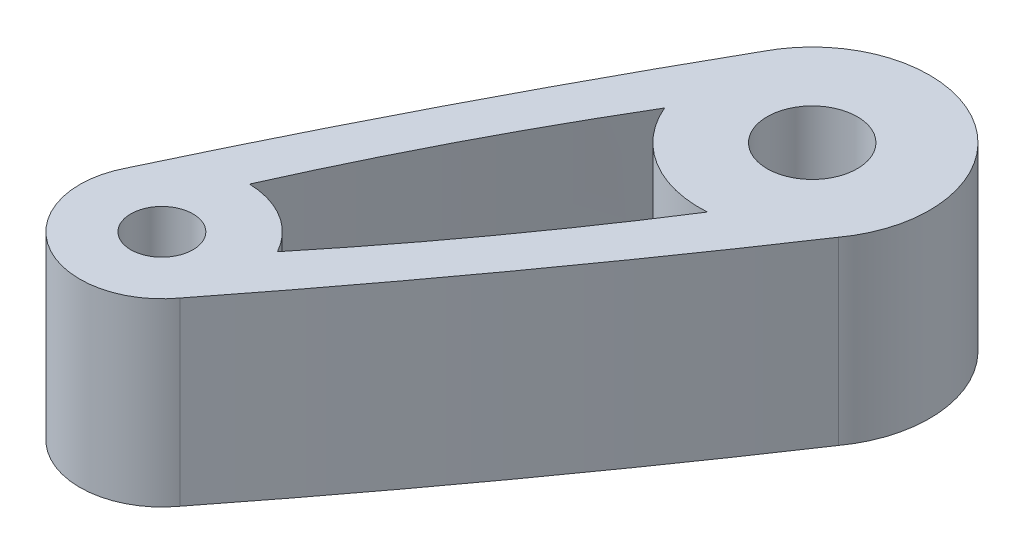
ISO-10303-21;
HEADER;
FILE_DESCRIPTION(('STEP AP214'),'2;1');
FILE_NAME('part.step','',(''),(''),'','','');
FILE_SCHEMA(('AUTOMOTIVE_DESIGN { 1 0 10303 214 1 1 1 1 }'));
ENDSEC;
DATA;
#1=APPLICATION_CONTEXT('core data for automotive mechanical design processes');
#2=APPLICATION_PROTOCOL_DEFINITION('international standard','automotive_design',2000,#1);
#3=PRODUCT_CONTEXT('',#1,'mechanical');
#4=PRODUCT('Part','Part','',(#3));
#5=PRODUCT_RELATED_PRODUCT_CATEGORY('part','',(#4));
#6=PRODUCT_DEFINITION_FORMATION('','',#4);
#7=PRODUCT_DEFINITION_CONTEXT('part definition',#1,'design');
#8=PRODUCT_DEFINITION('design','',#6,#7);
#9=PRODUCT_DEFINITION_SHAPE('','',#8);
#10=(LENGTH_UNIT() NAMED_UNIT(*) SI_UNIT(.MILLI.,.METRE.));
#11=(NAMED_UNIT(*) PLANE_ANGLE_UNIT() SI_UNIT($,.RADIAN.));
#12=(NAMED_UNIT(*) SI_UNIT($,.STERADIAN.) SOLID_ANGLE_UNIT());
#13=UNCERTAINTY_MEASURE_WITH_UNIT(LENGTH_MEASURE(1.E-05),#10,'distance_accuracy_value','');
#14=(GEOMETRIC_REPRESENTATION_CONTEXT(3) GLOBAL_UNCERTAINTY_ASSIGNED_CONTEXT((#13)) GLOBAL_UNIT_ASSIGNED_CONTEXT((#10,
#11,#12)) REPRESENTATION_CONTEXT('',''));
#15=CARTESIAN_POINT('',(0.,0.,0.));
#16=DIRECTION('',(0.,0.,1.));
#17=DIRECTION('',(1.,0.,0.));
#18=AXIS2_PLACEMENT_3D('',#15,#16,#17);
#19=CARTESIAN_POINT('',(-2.68957676151424,2.,-2.95338917117461));
#20=DIRECTION('',(0.,-1.,0.));
#21=DIRECTION('',(0.,0.,-1.));
#22=AXIS2_PLACEMENT_3D('',#19,#20,#21);
#23=PLANE('',#22);
#24=CARTESIAN_POINT('',(-2.25,2.,-5.86178146397045));
#25=DIRECTION('',(0.,1.,0.));
#26=DIRECTION('',(0.,0.,1.));
#27=AXIS2_PLACEMENT_3D('',#24,#25,#26);
#28=CIRCLE('',#27,0.5);
#29=CARTESIAN_POINT('',(-2.25,2.,-5.36178146397045));
#30=VERTEX_POINT('',#29);
#31=EDGE_CURVE('E187',#30,#30,#28,.T.);
#32=ORIENTED_EDGE('',*,*,#31,.F.);
#33=EDGE_LOOP('',(#32));
#34=FACE_BOUND('',#33,.T.);
#35=CARTESIAN_POINT('',(-4.26299987270819,2.,-0.866210891482546));
#36=CARTESIAN_POINT('',(-2.64908224902568,2.,-2.92406009927805));
#37=CARTESIAN_POINT('',(-1.19714267529741,2.,-5.0992255946598));
#38=B_SPLINE_CURVE_WITH_KNOTS('',2,(#35,#36,#37),.UNSPECIFIED.,.F.,.F.,(3,3),(0.,1.),.UNSPECIFIED.);
#39=CARTESIAN_POINT('',(-4.26299987270819,2.,-0.866210891482546));
#40=VERTEX_POINT('',#39);
#41=CARTESIAN_POINT('',(-1.19714267529741,2.,-5.0992255946598));
#42=VERTEX_POINT('',#41);
#43=EDGE_CURVE('E201',#40,#42,#38,.T.);
#44=ORIENTED_EDGE('',*,*,#43,.T.);
#45=CARTESIAN_POINT('',(-2.25,2.,-5.86178146397045));
#46=DIRECTION('',(0.,1.,0.));
#47=DIRECTION('',(0.,0.,1.));
#48=AXIS2_PLACEMENT_3D('',#45,#46,#47);
#49=CIRCLE('',#48,1.3);
#50=CARTESIAN_POINT('',(-3.40436808648253,2.,-6.459639574989));
#51=VERTEX_POINT('',#50);
#52=EDGE_CURVE('E175',#42,#51,#49,.T.);
#53=ORIENTED_EDGE('',*,*,#52,.T.);
#54=CARTESIAN_POINT('',(-3.40436808648253,2.,-6.459639574989));
#55=CARTESIAN_POINT('',(-4.69501041862419,2.,-4.18505921181395));
#56=CARTESIAN_POINT('',(-5.80805766053777,2.,-1.81850067771298));
#57=B_SPLINE_CURVE_WITH_KNOTS('',2,(#54,#55,#56),.UNSPECIFIED.,.F.,.F.,(3,3),(0.,1.),.UNSPECIFIED.);
#58=CARTESIAN_POINT('',(-5.80805766053777,2.,-1.81850067771298));
#59=VERTEX_POINT('',#58);
#60=EDGE_CURVE('E168',#51,#59,#57,.T.);
#61=ORIENTED_EDGE('',*,*,#60,.T.);
#62=CARTESIAN_POINT('',(-5.,2.,-1.4));
#63=DIRECTION('',(0.,1.,0.));
#64=DIRECTION('',(0.,0.,1.));
#65=AXIS2_PLACEMENT_3D('',#62,#63,#64);
#66=CIRCLE('',#65,0.910000000000002);
#67=EDGE_CURVE('E174',#59,#40,#66,.T.);
#68=ORIENTED_EDGE('',*,*,#67,.T.);
#69=EDGE_LOOP('',(#44,#53,#61,#68));
#70=FACE_BOUND('',#69,.T.);
#71=CARTESIAN_POINT('',(-3.40209110259025,2.,-5.3768215776578));
#72=CARTESIAN_POINT('',(-4.27614414276768,2.,-3.90682987079796));
#73=CARTESIAN_POINT('',(-4.97250723729984,2.,-2.34459999364763));
#74=B_SPLINE_CURVE_WITH_KNOTS('',2,(#71,#72,#73),.UNSPECIFIED.,.F.,.F.,(3,3),(0.,1.),.UNSPECIFIED.);
#75=CARTESIAN_POINT('',(-3.40209110259025,2.,-5.3768215776578));
#76=VERTEX_POINT('',#75);
#77=CARTESIAN_POINT('',(-4.97250723729984,2.,-2.34459999364763));
#78=VERTEX_POINT('',#77);
#79=EDGE_CURVE('E99',#76,#78,#74,.T.);
#80=ORIENTED_EDGE('',*,*,#79,.F.);
#81=CARTESIAN_POINT('',(-2.25,2.,-5.86178146397045));
#82=DIRECTION('',(0.,-1.,0.));
#83=DIRECTION('',(0.,0.,-1.));
#84=AXIS2_PLACEMENT_3D('',#81,#82,#83);
#85=CIRCLE('',#84,1.25);
#86=CARTESIAN_POINT('',(-2.16548087354991,2.,-4.61464213042984));
#87=VERTEX_POINT('',#86);
#88=EDGE_CURVE('E122',#87,#76,#85,.T.);
#89=ORIENTED_EDGE('',*,*,#88,.F.);
#90=CARTESIAN_POINT('',(-4.1685147351174,2.,-1.84906263959843));
#91=CARTESIAN_POINT('',(-3.08587133263036,2.,-3.17321029433291));
#92=CARTESIAN_POINT('',(-2.16548087354991,2.,-4.61464213042984));
#93=B_SPLINE_CURVE_WITH_KNOTS('',2,(#90,#91,#92),.UNSPECIFIED.,.F.,.F.,(3,3),(0.,1.),.UNSPECIFIED.);
#94=CARTESIAN_POINT('',(-4.1685147351174,2.,-1.84906263959843));
#95=VERTEX_POINT('',#94);
#96=EDGE_CURVE('E120',#95,#87,#93,.T.);
#97=ORIENTED_EDGE('',*,*,#96,.F.);
#98=CARTESIAN_POINT('',(-5.,2.,-1.4));
#99=DIRECTION('',(0.,-1.,0.));
#100=DIRECTION('',(0.,0.,-1.));
#101=AXIS2_PLACEMENT_3D('',#98,#99,#100);
#102=CIRCLE('',#101,0.945);
#103=EDGE_CURVE('E107',#78,#95,#102,.T.);
#104=ORIENTED_EDGE('',*,*,#103,.F.);
#105=EDGE_LOOP('',(#80,#89,#97,#104));
#106=FACE_BOUND('',#105,.T.);
#107=CARTESIAN_POINT('',(-5.,2.,-1.4));
#108=DIRECTION('',(0.,1.,0.));
#109=DIRECTION('',(0.,0.,1.));
#110=AXIS2_PLACEMENT_3D('',#107,#108,#109);
#111=CIRCLE('',#110,0.345);
#112=CARTESIAN_POINT('',(-5.,2.,-1.055));
#113=VERTEX_POINT('',#112);
#114=EDGE_CURVE('E249',#113,#113,#111,.T.);
#115=ORIENTED_EDGE('',*,*,#114,.F.);
#116=EDGE_LOOP('',(#115));
#117=FACE_BOUND('',#116,.T.);
#118=ADVANCED_FACE('F33',(#34,#70,#106,#117),#23,.F.);
#119=CARTESIAN_POINT('',(-2.68957676151424,0.,-2.95338917117461));
#120=DIRECTION('',(0.,-1.,0.));
#121=DIRECTION('',(0.,0.,-1.));
#122=AXIS2_PLACEMENT_3D('',#119,#120,#121);
#123=PLANE('',#122);
#124=CARTESIAN_POINT('',(-2.25,0.,-5.86178146397045));
#125=DIRECTION('',(0.,-1.,0.));
#126=DIRECTION('',(0.,0.,-1.));
#127=AXIS2_PLACEMENT_3D('',#124,#125,#126);
#128=CIRCLE('',#127,1.25);
#129=CARTESIAN_POINT('',(-2.16548087354991,0.,-4.61464213042984));
#130=VERTEX_POINT('',#129);
#131=CARTESIAN_POINT('',(-3.40209110259025,0.,-5.3768215776578));
#132=VERTEX_POINT('',#131);
#133=EDGE_CURVE('E108',#130,#132,#128,.T.);
#134=ORIENTED_EDGE('',*,*,#133,.T.);
#135=CARTESIAN_POINT('',(-3.40209110259025,0.,-5.3768215776578));
#136=CARTESIAN_POINT('',(-4.27614414276768,0.,-3.90682987079796));
#137=CARTESIAN_POINT('',(-4.97250723729984,0.,-2.34459999364763));
#138=B_SPLINE_CURVE_WITH_KNOTS('',2,(#135,#136,#137),.UNSPECIFIED.,.F.,.F.,(3,3),(0.,1.),.UNSPECIFIED.);
#139=CARTESIAN_POINT('',(-4.97250723729984,0.,-2.34459999364763));
#140=VERTEX_POINT('',#139);
#141=EDGE_CURVE('E57',#132,#140,#138,.T.);
#142=ORIENTED_EDGE('',*,*,#141,.T.);
#143=CARTESIAN_POINT('',(-5.,0.,-1.4));
#144=DIRECTION('',(0.,-1.,0.));
#145=DIRECTION('',(0.,0.,-1.));
#146=AXIS2_PLACEMENT_3D('',#143,#144,#145);
#147=CIRCLE('',#146,0.945);
#148=CARTESIAN_POINT('',(-4.1685147351174,0.,-1.84906263959843));
#149=VERTEX_POINT('',#148);
#150=EDGE_CURVE('E114',#140,#149,#147,.T.);
#151=ORIENTED_EDGE('',*,*,#150,.T.);
#152=CARTESIAN_POINT('',(-4.1685147351174,0.,-1.84906263959843));
#153=CARTESIAN_POINT('',(-3.08587133263036,0.,-3.17321029433291));
#154=CARTESIAN_POINT('',(-2.16548087354991,0.,-4.61464213042984));
#155=B_SPLINE_CURVE_WITH_KNOTS('',2,(#152,#153,#154),.UNSPECIFIED.,.F.,.F.,(3,3),(0.,1.),.UNSPECIFIED.);
#156=EDGE_CURVE('E239',#149,#130,#155,.T.);
#157=ORIENTED_EDGE('',*,*,#156,.T.);
#158=EDGE_LOOP('',(#134,#142,#151,#157));
#159=FACE_BOUND('',#158,.T.);
#160=CARTESIAN_POINT('',(-2.25,0.,-5.86178146397045));
#161=DIRECTION('',(0.,1.,0.));
#162=DIRECTION('',(0.,0.,1.));
#163=AXIS2_PLACEMENT_3D('',#160,#161,#162);
#164=CIRCLE('',#163,0.5);
#165=CARTESIAN_POINT('',(-2.25,0.,-5.36178146397045));
#166=VERTEX_POINT('',#165);
#167=EDGE_CURVE('E115',#166,#166,#164,.T.);
#168=ORIENTED_EDGE('',*,*,#167,.T.);
#169=EDGE_LOOP('',(#168));
#170=FACE_BOUND('',#169,.T.);
#171=CARTESIAN_POINT('',(-4.26299987270819,0.,-0.866210891482546));
#172=CARTESIAN_POINT('',(-2.64908224902568,0.,-2.92406009927805));
#173=CARTESIAN_POINT('',(-1.19714267529741,0.,-5.0992255946598));
#174=B_SPLINE_CURVE_WITH_KNOTS('',2,(#171,#172,#173),.UNSPECIFIED.,.F.,.F.,(3,3),(0.,1.),.UNSPECIFIED.);
#175=CARTESIAN_POINT('',(-4.26299987270819,0.,-0.866210891482546));
#176=VERTEX_POINT('',#175);
#177=CARTESIAN_POINT('',(-1.19714267529741,0.,-5.0992255946598));
#178=VERTEX_POINT('',#177);
#179=EDGE_CURVE('E181',#176,#178,#174,.T.);
#180=ORIENTED_EDGE('',*,*,#179,.F.);
#181=CARTESIAN_POINT('',(-5.,0.,-1.4));
#182=DIRECTION('',(0.,1.,0.));
#183=DIRECTION('',(0.,0.,1.));
#184=AXIS2_PLACEMENT_3D('',#181,#182,#183);
#185=CIRCLE('',#184,0.910000000000002);
#186=CARTESIAN_POINT('',(-5.80805766053777,0.,-1.81850067771298));
#187=VERTEX_POINT('',#186);
#188=EDGE_CURVE('E196',#187,#176,#185,.T.);
#189=ORIENTED_EDGE('',*,*,#188,.F.);
#190=CARTESIAN_POINT('',(-3.40436808648253,0.,-6.459639574989));
#191=CARTESIAN_POINT('',(-4.69501041862419,0.,-4.18505921181395));
#192=CARTESIAN_POINT('',(-5.80805766053777,0.,-1.81850067771298));
#193=B_SPLINE_CURVE_WITH_KNOTS('',2,(#190,#191,#192),.UNSPECIFIED.,.F.,.F.,(3,3),(0.,1.),.UNSPECIFIED.);
#194=CARTESIAN_POINT('',(-3.40436808648253,0.,-6.459639574989));
#195=VERTEX_POINT('',#194);
#196=EDGE_CURVE('E192',#195,#187,#193,.T.);
#197=ORIENTED_EDGE('',*,*,#196,.F.);
#198=CARTESIAN_POINT('',(-2.25,0.,-5.86178146397045));
#199=DIRECTION('',(0.,1.,0.));
#200=DIRECTION('',(0.,0.,1.));
#201=AXIS2_PLACEMENT_3D('',#198,#199,#200);
#202=CIRCLE('',#201,1.3);
#203=EDGE_CURVE('E186',#178,#195,#202,.T.);
#204=ORIENTED_EDGE('',*,*,#203,.F.);
#205=EDGE_LOOP('',(#180,#189,#197,#204));
#206=FACE_BOUND('',#205,.T.);
#207=CARTESIAN_POINT('',(-5.,0.,-1.4));
#208=DIRECTION('',(0.,1.,0.));
#209=DIRECTION('',(0.,0.,1.));
#210=AXIS2_PLACEMENT_3D('',#207,#208,#209);
#211=CIRCLE('',#210,0.345);
#212=CARTESIAN_POINT('',(-5.,0.,-1.055));
#213=VERTEX_POINT('',#212);
#214=EDGE_CURVE('E254',#213,#213,#211,.T.);
#215=ORIENTED_EDGE('',*,*,#214,.T.);
#216=EDGE_LOOP('',(#215));
#217=FACE_BOUND('',#216,.T.);
#218=ADVANCED_FACE('F155',(#159,#170,#206,#217),#123,.T.);
#219=DIRECTION('',(0.,-1.,0.));
#220=VECTOR('',#219,1.);
#221=SURFACE_OF_LINEAR_EXTRUSION('',#38,#220);
#222=ORIENTED_EDGE('',*,*,#179,.T.);
#223=DIRECTION('',(0.,-1.,0.));
#224=VECTOR('',#223,1.);
#225=CARTESIAN_POINT('',(-1.19714267529741,2.,-5.0992255946598));
#226=LINE('',#225,#224);
#227=EDGE_CURVE('E11',#42,#178,#226,.T.);
#228=ORIENTED_EDGE('',*,*,#227,.F.);
#229=ORIENTED_EDGE('',*,*,#43,.F.);
#230=DIRECTION('',(0.,-1.,0.));
#231=VECTOR('',#230,1.);
#232=CARTESIAN_POINT('',(-4.26299987270819,2.,-0.866210891482546));
#233=LINE('',#232,#231);
#234=EDGE_CURVE('E180',#40,#176,#233,.T.);
#235=ORIENTED_EDGE('',*,*,#234,.T.);
#236=EDGE_LOOP('',(#222,#228,#229,#235));
#237=FACE_BOUND('',#236,.T.);
#238=ADVANCED_FACE('F35',(#237),#221,.F.);
#239=CARTESIAN_POINT('',(-2.25,2.,-5.86178146397045));
#240=DIRECTION('',(0.,-1.,0.));
#241=DIRECTION('',(0.,0.,-1.));
#242=AXIS2_PLACEMENT_3D('',#239,#240,#241);
#243=CYLINDRICAL_SURFACE('',#242,1.3);
#244=ORIENTED_EDGE('',*,*,#203,.T.);
#245=DIRECTION('',(0.,-1.,0.));
#246=VECTOR('',#245,1.);
#247=CARTESIAN_POINT('',(-3.40436808648253,2.,-6.459639574989));
#248=LINE('',#247,#246);
#249=EDGE_CURVE('E42',#51,#195,#248,.T.);
#250=ORIENTED_EDGE('',*,*,#249,.F.);
#251=ORIENTED_EDGE('',*,*,#52,.F.);
#252=ORIENTED_EDGE('',*,*,#227,.T.);
#253=EDGE_LOOP('',(#244,#250,#251,#252));
#254=FACE_BOUND('',#253,.T.);
#255=ADVANCED_FACE('F166',(#254),#243,.T.);
#256=DIRECTION('',(0.,-1.,0.));
#257=VECTOR('',#256,1.);
#258=SURFACE_OF_LINEAR_EXTRUSION('',#57,#257);
#259=ORIENTED_EDGE('',*,*,#196,.T.);
#260=DIRECTION('',(0.,-1.,0.));
#261=VECTOR('',#260,1.);
#262=CARTESIAN_POINT('',(-5.80805766053777,2.,-1.81850067771298));
#263=LINE('',#262,#261);
#264=EDGE_CURVE('E204',#59,#187,#263,.T.);
#265=ORIENTED_EDGE('',*,*,#264,.F.);
#266=ORIENTED_EDGE('',*,*,#60,.F.);
#267=ORIENTED_EDGE('',*,*,#249,.T.);
#268=EDGE_LOOP('',(#259,#265,#266,#267));
#269=FACE_BOUND('',#268,.T.);
#270=ADVANCED_FACE('F162',(#269),#258,.F.);
#271=CARTESIAN_POINT('',(-5.,2.,-1.4));
#272=DIRECTION('',(0.,-1.,0.));
#273=DIRECTION('',(0.,0.,-1.));
#274=AXIS2_PLACEMENT_3D('',#271,#272,#273);
#275=CYLINDRICAL_SURFACE('',#274,0.910000000000002);
#276=ORIENTED_EDGE('',*,*,#188,.T.);
#277=ORIENTED_EDGE('',*,*,#234,.F.);
#278=ORIENTED_EDGE('',*,*,#67,.F.);
#279=ORIENTED_EDGE('',*,*,#264,.T.);
#280=EDGE_LOOP('',(#276,#277,#278,#279));
#281=FACE_BOUND('',#280,.T.);
#282=ADVANCED_FACE('F151',(#281),#275,.T.);
#283=CARTESIAN_POINT('',(-2.25,2.,-5.86178146397045));
#284=DIRECTION('',(0.,-1.,0.));
#285=DIRECTION('',(0.,0.,-1.));
#286=AXIS2_PLACEMENT_3D('',#283,#284,#285);
#287=CYLINDRICAL_SURFACE('',#286,0.5);
#288=ORIENTED_EDGE('',*,*,#31,.T.);
#289=EDGE_LOOP('',(#288));
#290=FACE_BOUND('',#289,.T.);
#291=ORIENTED_EDGE('',*,*,#167,.F.);
#292=EDGE_LOOP('',(#291));
#293=FACE_BOUND('',#292,.T.);
#294=ADVANCED_FACE('F148',(#290,#293),#287,.F.);
#295=DIRECTION('',(0.,-1.,0.));
#296=VECTOR('',#295,1.);
#297=SURFACE_OF_LINEAR_EXTRUSION('',#74,#296);
#298=ORIENTED_EDGE('',*,*,#141,.F.);
#299=DIRECTION('',(0.,-1.,0.));
#300=VECTOR('',#299,1.);
#301=CARTESIAN_POINT('',(-3.40209110259025,2.,-5.3768215776578));
#302=LINE('',#301,#300);
#303=EDGE_CURVE('E103',#76,#132,#302,.T.);
#304=ORIENTED_EDGE('',*,*,#303,.F.);
#305=ORIENTED_EDGE('',*,*,#79,.T.);
#306=DIRECTION('',(0.,-1.,0.));
#307=VECTOR('',#306,1.);
#308=CARTESIAN_POINT('',(-4.97250723729984,2.,-2.34459999364763));
#309=LINE('',#308,#307);
#310=EDGE_CURVE('E102',#78,#140,#309,.T.);
#311=ORIENTED_EDGE('',*,*,#310,.T.);
#312=EDGE_LOOP('',(#298,#304,#305,#311));
#313=FACE_BOUND('',#312,.T.);
#314=ADVANCED_FACE('F101',(#313),#297,.T.);
#315=CARTESIAN_POINT('',(-5.,2.,-1.4));
#316=DIRECTION('',(0.,-1.,0.));
#317=DIRECTION('',(0.,0.,-1.));
#318=AXIS2_PLACEMENT_3D('',#315,#316,#317);
#319=CYLINDRICAL_SURFACE('',#318,0.945);
#320=ORIENTED_EDGE('',*,*,#150,.F.);
#321=ORIENTED_EDGE('',*,*,#310,.F.);
#322=ORIENTED_EDGE('',*,*,#103,.T.);
#323=DIRECTION('',(0.,-1.,0.));
#324=VECTOR('',#323,1.);
#325=CARTESIAN_POINT('',(-4.1685147351174,2.,-1.84906263959843));
#326=LINE('',#325,#324);
#327=EDGE_CURVE('E116',#95,#149,#326,.T.);
#328=ORIENTED_EDGE('',*,*,#327,.T.);
#329=EDGE_LOOP('',(#320,#321,#322,#328));
#330=FACE_BOUND('',#329,.T.);
#331=ADVANCED_FACE('F111',(#330),#319,.T.);
#332=DIRECTION('',(0.,-1.,0.));
#333=VECTOR('',#332,1.);
#334=SURFACE_OF_LINEAR_EXTRUSION('',#93,#333);
#335=ORIENTED_EDGE('',*,*,#156,.F.);
#336=ORIENTED_EDGE('',*,*,#327,.F.);
#337=ORIENTED_EDGE('',*,*,#96,.T.);
#338=DIRECTION('',(0.,-1.,0.));
#339=VECTOR('',#338,1.);
#340=CARTESIAN_POINT('',(-2.16548087354991,2.,-4.61464213042984));
#341=LINE('',#340,#339);
#342=EDGE_CURVE('E49',#87,#130,#341,.T.);
#343=ORIENTED_EDGE('',*,*,#342,.T.);
#344=EDGE_LOOP('',(#335,#336,#337,#343));
#345=FACE_BOUND('',#344,.T.);
#346=ADVANCED_FACE('F137',(#345),#334,.T.);
#347=CARTESIAN_POINT('',(-2.25,2.,-5.86178146397045));
#348=DIRECTION('',(0.,-1.,0.));
#349=DIRECTION('',(0.,0.,-1.));
#350=AXIS2_PLACEMENT_3D('',#347,#348,#349);
#351=CYLINDRICAL_SURFACE('',#350,1.25);
#352=ORIENTED_EDGE('',*,*,#133,.F.);
#353=ORIENTED_EDGE('',*,*,#342,.F.);
#354=ORIENTED_EDGE('',*,*,#88,.T.);
#355=ORIENTED_EDGE('',*,*,#303,.T.);
#356=EDGE_LOOP('',(#352,#353,#354,#355));
#357=FACE_BOUND('',#356,.T.);
#358=ADVANCED_FACE('F141',(#357),#351,.T.);
#359=CARTESIAN_POINT('',(-5.,2.,-1.4));
#360=DIRECTION('',(0.,-1.,0.));
#361=DIRECTION('',(0.,0.,-1.));
#362=AXIS2_PLACEMENT_3D('',#359,#360,#361);
#363=CYLINDRICAL_SURFACE('',#362,0.345);
#364=ORIENTED_EDGE('',*,*,#114,.T.);
#365=EDGE_LOOP('',(#364));
#366=FACE_BOUND('',#365,.T.);
#367=ORIENTED_EDGE('',*,*,#214,.F.);
#368=EDGE_LOOP('',(#367));
#369=FACE_BOUND('',#368,.T.);
#370=ADVANCED_FACE('F261',(#366,#369),#363,.F.);
#371=CLOSED_SHELL('',(#118,#218,#238,#255,#270,#282,#294,#314,#331,#346,#358,#370));
#372=MANIFOLD_SOLID_BREP('B2',#371);
#373=ADVANCED_BREP_SHAPE_REPRESENTATION('',(#18,#372),#14);
#374=SHAPE_DEFINITION_REPRESENTATION(#9,#373);
ENDSEC;
END-ISO-10303-21;
